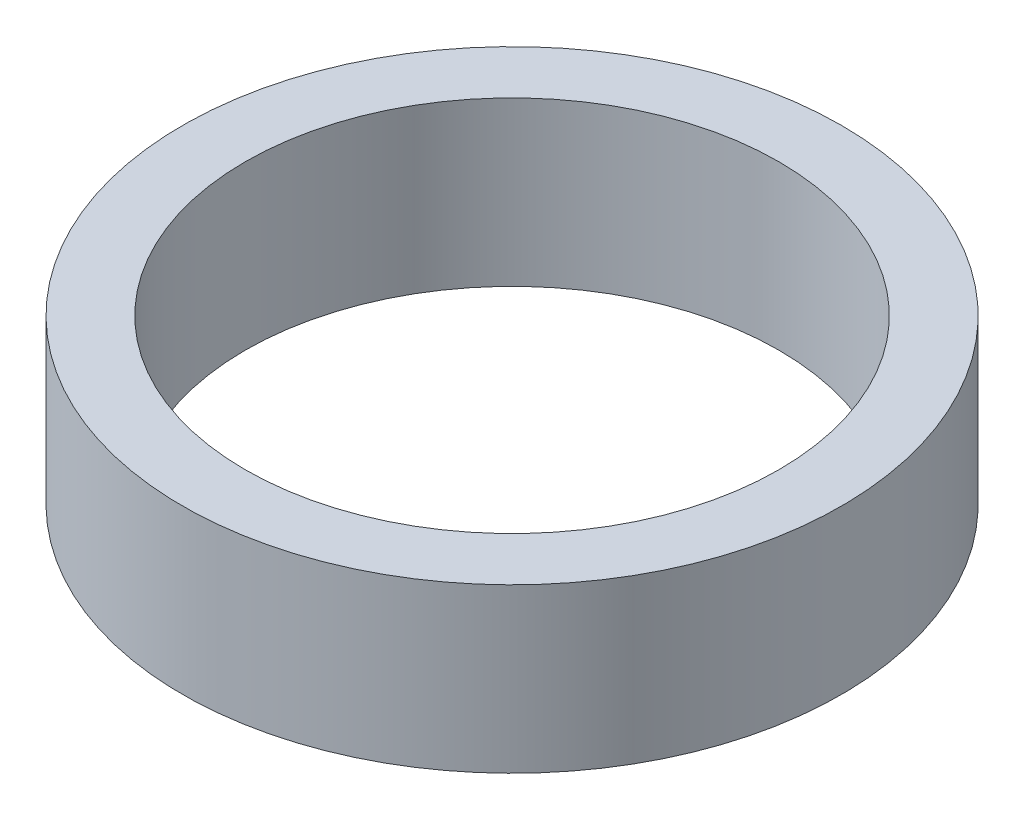
ISO-10303-21;
HEADER;
FILE_DESCRIPTION(('STEP AP214'),'2;1');
FILE_NAME('part.step','',(''),(''),'','','');
FILE_SCHEMA(('AUTOMOTIVE_DESIGN { 1 0 10303 214 1 1 1 1 }'));
ENDSEC;
DATA;
#1=APPLICATION_CONTEXT('core data for automotive mechanical design processes');
#2=APPLICATION_PROTOCOL_DEFINITION('international standard','automotive_design',2000,#1);
#3=PRODUCT_CONTEXT('',#1,'mechanical');
#4=PRODUCT('Part','Part','',(#3));
#5=PRODUCT_RELATED_PRODUCT_CATEGORY('part','',(#4));
#6=PRODUCT_DEFINITION_FORMATION('','',#4);
#7=PRODUCT_DEFINITION_CONTEXT('part definition',#1,'design');
#8=PRODUCT_DEFINITION('design','',#6,#7);
#9=PRODUCT_DEFINITION_SHAPE('','',#8);
#10=(LENGTH_UNIT() NAMED_UNIT(*) SI_UNIT(.MILLI.,.METRE.));
#11=(NAMED_UNIT(*) PLANE_ANGLE_UNIT() SI_UNIT($,.RADIAN.));
#12=(NAMED_UNIT(*) SI_UNIT($,.STERADIAN.) SOLID_ANGLE_UNIT());
#13=UNCERTAINTY_MEASURE_WITH_UNIT(LENGTH_MEASURE(1.E-05),#10,'distance_accuracy_value','');
#14=(GEOMETRIC_REPRESENTATION_CONTEXT(3) GLOBAL_UNCERTAINTY_ASSIGNED_CONTEXT((#13)) GLOBAL_UNIT_ASSIGNED_CONTEXT((#10,
#11,#12)) REPRESENTATION_CONTEXT('',''));
#15=CARTESIAN_POINT('',(0.,0.,0.));
#16=DIRECTION('',(0.,0.,1.));
#17=DIRECTION('',(1.,0.,0.));
#18=AXIS2_PLACEMENT_3D('',#15,#16,#17);
#19=CARTESIAN_POINT('',(0.,26.,0.));
#20=DIRECTION('',(0.,-1.,0.));
#21=DIRECTION('',(0.,0.,-1.));
#22=AXIS2_PLACEMENT_3D('',#19,#20,#21);
#23=CYLINDRICAL_SURFACE('',#22,52.5);
#24=CARTESIAN_POINT('',(0.,26.,0.));
#25=DIRECTION('',(0.,1.,0.));
#26=DIRECTION('',(0.,0.,1.));
#27=AXIS2_PLACEMENT_3D('',#24,#25,#26);
#28=CIRCLE('',#27,52.5);
#29=CARTESIAN_POINT('',(0.,26.,-52.5));
#30=VERTEX_POINT('',#29);
#31=EDGE_CURVE('E10',#30,#30,#28,.T.);
#32=CARTESIAN_POINT('',(0.,0.,0.));
#33=DIRECTION('',(0.,1.,0.));
#34=DIRECTION('',(0.,0.,1.));
#35=AXIS2_PLACEMENT_3D('',#32,#33,#34);
#36=CIRCLE('',#35,52.5);
#37=CARTESIAN_POINT('',(0.,0.,-52.5));
#38=VERTEX_POINT('',#37);
#39=EDGE_CURVE('E37',#38,#38,#36,.T.);
#40=CARTESIAN_POINT('',(0.,26.,-52.5));
#41=CARTESIAN_POINT('',(0.,25.7291666666667,-52.5));
#42=CARTESIAN_POINT('',(0.,25.4583333333333,-52.5));
#43=CARTESIAN_POINT('',(0.,24.9166666666667,-52.5));
#44=CARTESIAN_POINT('',(0.,24.6458333333333,-52.5));
#45=CARTESIAN_POINT('',(0.,24.1041666666667,-52.5));
#46=CARTESIAN_POINT('',(0.,23.8333333333333,-52.5));
#47=CARTESIAN_POINT('',(0.,23.2916666666667,-52.5));
#48=CARTESIAN_POINT('',(0.,23.0208333333333,-52.5));
#49=CARTESIAN_POINT('',(0.,22.4791666666667,-52.5));
#50=CARTESIAN_POINT('',(0.,22.2083333333333,-52.5));
#51=CARTESIAN_POINT('',(0.,21.6666666666667,-52.5));
#52=CARTESIAN_POINT('',(0.,21.3958333333333,-52.5));
#53=CARTESIAN_POINT('',(0.,20.8541666666667,-52.5));
#54=CARTESIAN_POINT('',(0.,20.5833333333333,-52.5));
#55=CARTESIAN_POINT('',(0.,20.0416666666667,-52.5));
#56=CARTESIAN_POINT('',(0.,19.7708333333333,-52.5));
#57=CARTESIAN_POINT('',(0.,19.2291666666667,-52.5));
#58=CARTESIAN_POINT('',(0.,18.9583333333333,-52.5));
#59=CARTESIAN_POINT('',(0.,18.4166666666667,-52.5));
#60=CARTESIAN_POINT('',(0.,18.1458333333333,-52.5));
#61=CARTESIAN_POINT('',(0.,17.6041666666667,-52.5));
#62=CARTESIAN_POINT('',(0.,17.3333333333333,-52.5));
#63=CARTESIAN_POINT('',(0.,16.7916666666667,-52.5));
#64=CARTESIAN_POINT('',(0.,16.5208333333333,-52.5));
#65=CARTESIAN_POINT('',(0.,15.9791666666667,-52.5));
#66=CARTESIAN_POINT('',(0.,15.7083333333333,-52.5));
#67=CARTESIAN_POINT('',(0.,15.1666666666667,-52.5));
#68=CARTESIAN_POINT('',(0.,14.8958333333333,-52.5));
#69=CARTESIAN_POINT('',(0.,14.3541666666667,-52.5));
#70=CARTESIAN_POINT('',(0.,14.0833333333333,-52.5));
#71=CARTESIAN_POINT('',(0.,13.5416666666667,-52.5));
#72=CARTESIAN_POINT('',(0.,13.2708333333333,-52.5));
#73=CARTESIAN_POINT('',(0.,12.7291666666667,-52.5));
#74=CARTESIAN_POINT('',(0.,12.4583333333333,-52.5));
#75=CARTESIAN_POINT('',(0.,11.9166666666667,-52.5));
#76=CARTESIAN_POINT('',(0.,11.6458333333333,-52.5));
#77=CARTESIAN_POINT('',(0.,11.1041666666667,-52.5));
#78=CARTESIAN_POINT('',(0.,10.8333333333333,-52.5));
#79=CARTESIAN_POINT('',(0.,10.2916666666667,-52.5));
#80=CARTESIAN_POINT('',(0.,10.0208333333333,-52.5));
#81=CARTESIAN_POINT('',(0.,9.47916666666667,-52.5));
#82=CARTESIAN_POINT('',(0.,9.20833333333333,-52.5));
#83=CARTESIAN_POINT('',(0.,8.66666666666667,-52.5));
#84=CARTESIAN_POINT('',(0.,8.39583333333333,-52.5));
#85=CARTESIAN_POINT('',(0.,7.85416666666667,-52.5));
#86=CARTESIAN_POINT('',(0.,7.58333333333333,-52.5));
#87=CARTESIAN_POINT('',(0.,7.04166666666667,-52.5));
#88=CARTESIAN_POINT('',(0.,6.77083333333333,-52.5));
#89=CARTESIAN_POINT('',(0.,6.22916666666667,-52.5));
#90=CARTESIAN_POINT('',(0.,5.95833333333333,-52.5));
#91=CARTESIAN_POINT('',(0.,5.41666666666667,-52.5));
#92=CARTESIAN_POINT('',(0.,5.14583333333333,-52.5));
#93=CARTESIAN_POINT('',(0.,4.60416666666667,-52.5));
#94=CARTESIAN_POINT('',(0.,4.33333333333333,-52.5));
#95=CARTESIAN_POINT('',(0.,3.79166666666667,-52.5));
#96=CARTESIAN_POINT('',(0.,3.52083333333333,-52.5));
#97=CARTESIAN_POINT('',(0.,2.97916666666667,-52.5));
#98=CARTESIAN_POINT('',(0.,2.70833333333333,-52.5));
#99=CARTESIAN_POINT('',(0.,2.16666666666667,-52.5));
#100=CARTESIAN_POINT('',(0.,1.89583333333333,-52.5));
#101=CARTESIAN_POINT('',(0.,1.35416666666667,-52.5));
#102=CARTESIAN_POINT('',(0.,1.08333333333333,-52.5));
#103=CARTESIAN_POINT('',(0.,0.541666666666667,-52.5));
#104=CARTESIAN_POINT('',(0.,0.270833333333334,-52.5));
#105=CARTESIAN_POINT('',(0.,0.,-52.5));
#106=B_SPLINE_CURVE_WITH_KNOTS('',3,(#40,#41,#42,#43,#44,#45,#46,#47,#48,#49,#50,#51,#52,#53,
#54,#55,#56,#57,#58,#59,#60,#61,#62,#63,#64,#65,#66,#67,#68,#69,#70,#71,#72,#73,#74,#75,#76,#77,
#78,#79,#80,#81,#82,#83,#84,#85,#86,#87,#88,#89,#90,#91,#92,#93,#94,#95,#96,#97,#98,#99,#100,
#101,#102,#103,#104,#105),.UNSPECIFIED.,.F.,.F.,(4,2,2,2,2,2,2,2,2,2,2,2,2,2,2,2,2,2,2,2,2,2,2,
2,2,2,2,2,2,2,2,2,4),(0.,0.812499999999997,1.625,2.4375,3.25,4.0625,4.875,5.6875,6.5,7.3125,
8.125,8.93749999999999,9.74999999999999,10.5625,11.375,12.1875,13.,13.8125,14.625,15.4375,16.25,
17.0625,17.875,18.6875,19.5,20.3125,21.125,21.9375,22.75,23.5625,24.375,25.1875,26.),.UNSPECIFIED.);
#107=EDGE_CURVE('BSEAM40',#30,#38,#106,.T.);
#108=ORIENTED_EDGE('',*,*,#31,.F.);
#109=ORIENTED_EDGE('',*,*,#39,.T.);
#110=ORIENTED_EDGE('',*,*,#107,.T.);
#111=ORIENTED_EDGE('',*,*,#107,.F.);
#112=EDGE_LOOP('',(#108,#110,#109,#111));
#113=FACE_BOUND('',#112,.T.);
#114=ADVANCED_FACE('F40',(#113),#23,.T.);
#115=CARTESIAN_POINT('',(0.,26.,0.));
#116=DIRECTION('',(0.,1.,0.));
#117=DIRECTION('',(0.,0.,1.));
#118=AXIS2_PLACEMENT_3D('',#115,#116,#117);
#119=PLANE('',#118);
#120=CARTESIAN_POINT('',(0.,26.,0.));
#121=DIRECTION('',(0.,1.,0.));
#122=DIRECTION('',(0.,0.,1.));
#123=AXIS2_PLACEMENT_3D('',#120,#121,#122);
#124=CIRCLE('',#123,42.5);
#125=CARTESIAN_POINT('',(0.,26.,-42.5));
#126=VERTEX_POINT('',#125);
#127=EDGE_CURVE('E50',#126,#126,#124,.T.);
#128=ORIENTED_EDGE('',*,*,#127,.F.);
#129=EDGE_LOOP('',(#128));
#130=FACE_BOUND('',#129,.T.);
#131=ORIENTED_EDGE('',*,*,#31,.T.);
#132=EDGE_LOOP('',(#131));
#133=FACE_BOUND('',#132,.T.);
#134=ADVANCED_FACE('F59',(#130,#133),#119,.T.);
#135=CARTESIAN_POINT('',(0.,0.,0.));
#136=DIRECTION('',(0.,1.,0.));
#137=DIRECTION('',(0.,0.,1.));
#138=AXIS2_PLACEMENT_3D('',#135,#136,#137);
#139=PLANE('',#138);
#140=CARTESIAN_POINT('',(0.,0.,0.));
#141=DIRECTION('',(0.,1.,0.));
#142=DIRECTION('',(0.,0.,1.));
#143=AXIS2_PLACEMENT_3D('',#140,#141,#142);
#144=CIRCLE('',#143,42.5);
#145=CARTESIAN_POINT('',(0.,0.,-42.5));
#146=VERTEX_POINT('',#145);
#147=EDGE_CURVE('E47',#146,#146,#144,.T.);
#148=ORIENTED_EDGE('',*,*,#147,.T.);
#149=EDGE_LOOP('',(#148));
#150=FACE_BOUND('',#149,.T.);
#151=ORIENTED_EDGE('',*,*,#39,.F.);
#152=EDGE_LOOP('',(#151));
#153=FACE_BOUND('',#152,.T.);
#154=ADVANCED_FACE('F58',(#150,#153),#139,.F.);
#155=CARTESIAN_POINT('',(0.,26.,0.));
#156=DIRECTION('',(0.,-1.,0.));
#157=DIRECTION('',(0.,0.,-1.));
#158=AXIS2_PLACEMENT_3D('',#155,#156,#157);
#159=CYLINDRICAL_SURFACE('',#158,42.5);
#160=CARTESIAN_POINT('',(0.,26.,-42.5));
#161=CARTESIAN_POINT('',(0.,25.7291666666667,-42.5));
#162=CARTESIAN_POINT('',(0.,25.4583333333333,-42.5));
#163=CARTESIAN_POINT('',(0.,24.9166666666667,-42.5));
#164=CARTESIAN_POINT('',(0.,24.6458333333333,-42.5));
#165=CARTESIAN_POINT('',(0.,24.1041666666667,-42.5));
#166=CARTESIAN_POINT('',(0.,23.8333333333333,-42.5));
#167=CARTESIAN_POINT('',(0.,23.2916666666667,-42.5));
#168=CARTESIAN_POINT('',(0.,23.0208333333333,-42.5));
#169=CARTESIAN_POINT('',(0.,22.4791666666667,-42.5));
#170=CARTESIAN_POINT('',(0.,22.2083333333333,-42.5));
#171=CARTESIAN_POINT('',(0.,21.6666666666667,-42.5));
#172=CARTESIAN_POINT('',(0.,21.3958333333333,-42.5));
#173=CARTESIAN_POINT('',(0.,20.8541666666667,-42.5));
#174=CARTESIAN_POINT('',(0.,20.5833333333333,-42.5));
#175=CARTESIAN_POINT('',(0.,20.0416666666667,-42.5));
#176=CARTESIAN_POINT('',(0.,19.7708333333333,-42.5));
#177=CARTESIAN_POINT('',(0.,19.2291666666667,-42.5));
#178=CARTESIAN_POINT('',(0.,18.9583333333333,-42.5));
#179=CARTESIAN_POINT('',(0.,18.4166666666667,-42.5));
#180=CARTESIAN_POINT('',(0.,18.1458333333333,-42.5));
#181=CARTESIAN_POINT('',(0.,17.6041666666667,-42.5));
#182=CARTESIAN_POINT('',(0.,17.3333333333333,-42.5));
#183=CARTESIAN_POINT('',(0.,16.7916666666667,-42.5));
#184=CARTESIAN_POINT('',(0.,16.5208333333333,-42.5));
#185=CARTESIAN_POINT('',(0.,15.9791666666667,-42.5));
#186=CARTESIAN_POINT('',(0.,15.7083333333333,-42.5));
#187=CARTESIAN_POINT('',(0.,15.1666666666667,-42.5));
#188=CARTESIAN_POINT('',(0.,14.8958333333333,-42.5));
#189=CARTESIAN_POINT('',(0.,14.3541666666667,-42.5));
#190=CARTESIAN_POINT('',(0.,14.0833333333333,-42.5));
#191=CARTESIAN_POINT('',(0.,13.5416666666667,-42.5));
#192=CARTESIAN_POINT('',(0.,13.2708333333333,-42.5));
#193=CARTESIAN_POINT('',(0.,12.7291666666667,-42.5));
#194=CARTESIAN_POINT('',(0.,12.4583333333333,-42.5));
#195=CARTESIAN_POINT('',(0.,11.9166666666667,-42.5));
#196=CARTESIAN_POINT('',(0.,11.6458333333333,-42.5));
#197=CARTESIAN_POINT('',(0.,11.1041666666667,-42.5));
#198=CARTESIAN_POINT('',(0.,10.8333333333333,-42.5));
#199=CARTESIAN_POINT('',(0.,10.2916666666667,-42.5));
#200=CARTESIAN_POINT('',(0.,10.0208333333333,-42.5));
#201=CARTESIAN_POINT('',(0.,9.47916666666667,-42.5));
#202=CARTESIAN_POINT('',(0.,9.20833333333333,-42.5));
#203=CARTESIAN_POINT('',(0.,8.66666666666667,-42.5));
#204=CARTESIAN_POINT('',(0.,8.39583333333333,-42.5));
#205=CARTESIAN_POINT('',(0.,7.85416666666667,-42.5));
#206=CARTESIAN_POINT('',(0.,7.58333333333333,-42.5));
#207=CARTESIAN_POINT('',(0.,7.04166666666667,-42.5));
#208=CARTESIAN_POINT('',(0.,6.77083333333333,-42.5));
#209=CARTESIAN_POINT('',(0.,6.22916666666667,-42.5));
#210=CARTESIAN_POINT('',(0.,5.95833333333333,-42.5));
#211=CARTESIAN_POINT('',(0.,5.41666666666667,-42.5));
#212=CARTESIAN_POINT('',(0.,5.14583333333333,-42.5));
#213=CARTESIAN_POINT('',(0.,4.60416666666667,-42.5));
#214=CARTESIAN_POINT('',(0.,4.33333333333333,-42.5));
#215=CARTESIAN_POINT('',(0.,3.79166666666667,-42.5));
#216=CARTESIAN_POINT('',(0.,3.52083333333333,-42.5));
#217=CARTESIAN_POINT('',(0.,2.97916666666667,-42.5));
#218=CARTESIAN_POINT('',(0.,2.70833333333333,-42.5));
#219=CARTESIAN_POINT('',(0.,2.16666666666667,-42.5));
#220=CARTESIAN_POINT('',(0.,1.89583333333333,-42.5));
#221=CARTESIAN_POINT('',(0.,1.35416666666667,-42.5));
#222=CARTESIAN_POINT('',(0.,1.08333333333333,-42.5));
#223=CARTESIAN_POINT('',(0.,0.541666666666667,-42.5));
#224=CARTESIAN_POINT('',(0.,0.270833333333334,-42.5));
#225=CARTESIAN_POINT('',(0.,0.,-42.5));
#226=B_SPLINE_CURVE_WITH_KNOTS('',3,(#160,#161,#162,#163,#164,#165,#166,#167,#168,#169,#170,
#171,#172,#173,#174,#175,#176,#177,#178,#179,#180,#181,#182,#183,#184,#185,#186,#187,#188,#189,
#190,#191,#192,#193,#194,#195,#196,#197,#198,#199,#200,#201,#202,#203,#204,#205,#206,#207,#208,
#209,#210,#211,#212,#213,#214,#215,#216,#217,#218,#219,#220,#221,#222,#223,#224,#225),
.UNSPECIFIED.,.F.,.F.,(4,2,2,2,2,2,2,2,2,2,2,2,2,2,2,2,2,2,2,2,2,2,2,2,2,2,2,2,2,2,2,2,4),(0.,
0.812499999999997,1.625,2.4375,3.25,4.0625,4.875,5.6875,6.5,7.3125,8.125,8.93749999999999,
9.74999999999999,10.5625,11.375,12.1875,13.,13.8125,14.625,15.4375,16.25,17.0625,17.875,18.6875,
19.5,20.3125,21.125,21.9375,22.75,23.5625,24.375,25.1875,26.),.UNSPECIFIED.);
#227=EDGE_CURVE('BSEAM54',#126,#146,#226,.T.);
#228=ORIENTED_EDGE('',*,*,#127,.T.);
#229=ORIENTED_EDGE('',*,*,#147,.F.);
#230=ORIENTED_EDGE('',*,*,#227,.T.);
#231=ORIENTED_EDGE('',*,*,#227,.F.);
#232=EDGE_LOOP('',(#228,#230,#229,#231));
#233=FACE_BOUND('',#232,.T.);
#234=ADVANCED_FACE('F54',(#233),#159,.F.);
#235=CLOSED_SHELL('',(#114,#134,#154,#234));
#236=MANIFOLD_SOLID_BREP('B2',#235);
#237=ADVANCED_BREP_SHAPE_REPRESENTATION('',(#18,#236),#14);
#238=SHAPE_DEFINITION_REPRESENTATION(#9,#237);
ENDSEC;
END-ISO-10303-21;
